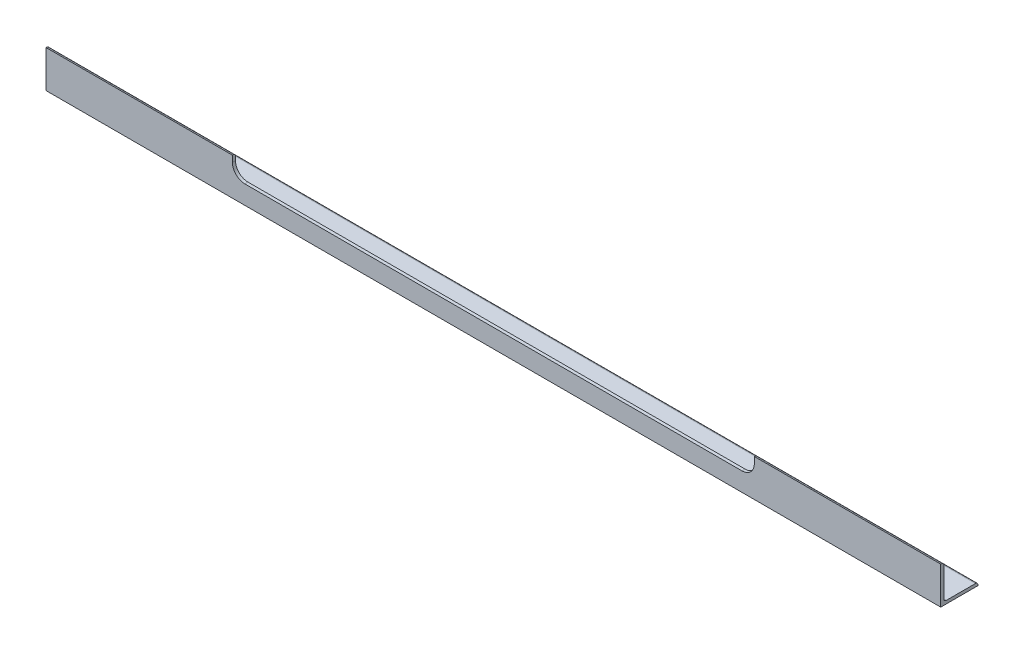
ISO-10303-21;
HEADER;
FILE_DESCRIPTION(('STEP AP214'),'2;1');
FILE_NAME('part.step','',(''),(''),'','','');
FILE_SCHEMA(('AUTOMOTIVE_DESIGN { 1 0 10303 214 1 1 1 1 }'));
ENDSEC;
DATA;
#1=APPLICATION_CONTEXT('core data for automotive mechanical design processes');
#2=APPLICATION_PROTOCOL_DEFINITION('international standard','automotive_design',2000,#1);
#3=PRODUCT_CONTEXT('',#1,'mechanical');
#4=PRODUCT('Part','Part','',(#3));
#5=PRODUCT_RELATED_PRODUCT_CATEGORY('part','',(#4));
#6=PRODUCT_DEFINITION_FORMATION('','',#4);
#7=PRODUCT_DEFINITION_CONTEXT('part definition',#1,'design');
#8=PRODUCT_DEFINITION('design','',#6,#7);
#9=PRODUCT_DEFINITION_SHAPE('','',#8);
#10=(LENGTH_UNIT() NAMED_UNIT(*) SI_UNIT(.MILLI.,.METRE.));
#11=(NAMED_UNIT(*) PLANE_ANGLE_UNIT() SI_UNIT($,.RADIAN.));
#12=(NAMED_UNIT(*) SI_UNIT($,.STERADIAN.) SOLID_ANGLE_UNIT());
#13=UNCERTAINTY_MEASURE_WITH_UNIT(LENGTH_MEASURE(1.E-05),#10,'distance_accuracy_value','');
#14=(GEOMETRIC_REPRESENTATION_CONTEXT(3) GLOBAL_UNCERTAINTY_ASSIGNED_CONTEXT((#13)) GLOBAL_UNIT_ASSIGNED_CONTEXT((#10,
#11,#12)) REPRESENTATION_CONTEXT('',''));
#15=CARTESIAN_POINT('',(0.,0.,0.));
#16=DIRECTION('',(0.,0.,1.));
#17=DIRECTION('',(1.,0.,0.));
#18=AXIS2_PLACEMENT_3D('',#15,#16,#17);
#19=CARTESIAN_POINT('',(-914.4,76.2,0.));
#20=DIRECTION('',(0.,1.,0.));
#21=DIRECTION('',(0.,0.,1.));
#22=AXIS2_PLACEMENT_3D('',#19,#20,#21);
#23=PLANE('',#22);
#24=DIRECTION('',(0.,0.,1.));
#25=VECTOR('',#24,1.);
#26=CARTESIAN_POINT('',(-533.4,76.2,-76.2));
#27=LINE('',#26,#25);
#28=CARTESIAN_POINT('',(-533.4,76.2,-1.27000000000002));
#29=VERTEX_POINT('',#28);
#30=CARTESIAN_POINT('',(-533.4,76.2,0.));
#31=VERTEX_POINT('',#30);
#32=EDGE_CURVE('E164',#29,#31,#27,.T.);
#33=ORIENTED_EDGE('',*,*,#32,.F.);
#34=DIRECTION('',(1.,0.,0.));
#35=VECTOR('',#34,1.);
#36=CARTESIAN_POINT('',(-914.4,76.2,-1.26999999999996));
#37=LINE('',#36,#35);
#38=CARTESIAN_POINT('',(-914.4,76.2,-1.26999999999996));
#39=VERTEX_POINT('',#38);
#40=EDGE_CURVE('E183',#39,#29,#37,.T.);
#41=ORIENTED_EDGE('',*,*,#40,.F.);
#42=DIRECTION('',(0.,0.,1.));
#43=VECTOR('',#42,1.);
#44=CARTESIAN_POINT('',(-914.4,76.2,0.));
#45=LINE('',#44,#43);
#46=CARTESIAN_POINT('',(-914.4,76.2,0.));
#47=VERTEX_POINT('',#46);
#48=EDGE_CURVE('E245',#39,#47,#45,.T.);
#49=ORIENTED_EDGE('',*,*,#48,.T.);
#50=DIRECTION('',(1.,0.,0.));
#51=VECTOR('',#50,1.);
#52=CARTESIAN_POINT('',(-914.4,76.2,0.));
#53=LINE('',#52,#51);
#54=EDGE_CURVE('E170',#47,#31,#53,.T.);
#55=ORIENTED_EDGE('',*,*,#54,.T.);
#56=EDGE_LOOP('',(#33,#41,#49,#55));
#57=FACE_BOUND('',#56,.T.);
#58=ADVANCED_FACE('F34',(#57),#23,.T.);
#59=CARTESIAN_POINT('',(-914.4,71.12,-1.27));
#60=DIRECTION('',(1.,0.,0.));
#61=DIRECTION('',(0.,0.,-1.));
#62=AXIS2_PLACEMENT_3D('',#59,#60,#61);
#63=CYLINDRICAL_SURFACE('',#62,5.08);
#64=CARTESIAN_POINT('',(-533.4,71.12,-1.27));
#65=DIRECTION('',(-1.,0.,0.));
#66=DIRECTION('',(0.,0.,1.));
#67=AXIS2_PLACEMENT_3D('',#64,#65,#66);
#68=CIRCLE('',#67,5.08);
#69=CARTESIAN_POINT('',(-533.4,71.12,-6.35));
#70=VERTEX_POINT('',#69);
#71=EDGE_CURVE('E219',#70,#29,#68,.F.);
#72=ORIENTED_EDGE('',*,*,#71,.F.);
#73=DIRECTION('',(1.,0.,0.));
#74=VECTOR('',#73,1.);
#75=CARTESIAN_POINT('',(-914.4,71.12,-6.35));
#76=LINE('',#75,#74);
#77=CARTESIAN_POINT('',(-914.4,71.12,-6.35));
#78=VERTEX_POINT('',#77);
#79=EDGE_CURVE('E270',#78,#70,#76,.T.);
#80=ORIENTED_EDGE('',*,*,#79,.F.);
#81=CARTESIAN_POINT('',(-914.4,71.12,-1.27));
#82=DIRECTION('',(1.,0.,0.));
#83=DIRECTION('',(0.,0.,-1.));
#84=AXIS2_PLACEMENT_3D('',#81,#82,#83);
#85=CIRCLE('',#84,5.08);
#86=EDGE_CURVE('E171',#78,#39,#85,.T.);
#87=ORIENTED_EDGE('',*,*,#86,.T.);
#88=ORIENTED_EDGE('',*,*,#40,.T.);
#89=EDGE_LOOP('',(#72,#80,#87,#88));
#90=FACE_BOUND('',#89,.T.);
#91=ADVANCED_FACE('F303',(#90),#63,.T.);
#92=DIRECTION('',(0.,0.,1.));
#93=VECTOR('',#92,1.);
#94=CARTESIAN_POINT('',(533.4,76.2,-76.2));
#95=LINE('',#94,#93);
#96=CARTESIAN_POINT('',(533.4,76.2,-1.27));
#97=VERTEX_POINT('',#96);
#98=CARTESIAN_POINT('',(533.4,76.2,0.));
#99=VERTEX_POINT('',#98);
#100=EDGE_CURVE('E150',#97,#99,#95,.T.);
#101=ORIENTED_EDGE('',*,*,#100,.T.);
#102=CARTESIAN_POINT('',(914.4,76.2,0.));
#103=VERTEX_POINT('',#102);
#104=EDGE_CURVE('E161',#99,#103,#53,.T.);
#105=ORIENTED_EDGE('',*,*,#104,.T.);
#106=DIRECTION('',(0.,0.,1.));
#107=VECTOR('',#106,1.);
#108=CARTESIAN_POINT('',(914.4,76.2,0.));
#109=LINE('',#108,#107);
#110=CARTESIAN_POINT('',(914.4,76.2,-1.26999999999996));
#111=VERTEX_POINT('',#110);
#112=EDGE_CURVE('E221',#111,#103,#109,.T.);
#113=ORIENTED_EDGE('',*,*,#112,.F.);
#114=EDGE_CURVE('E163',#97,#111,#37,.T.);
#115=ORIENTED_EDGE('',*,*,#114,.F.);
#116=EDGE_LOOP('',(#101,#105,#113,#115));
#117=FACE_BOUND('',#116,.T.);
#118=ADVANCED_FACE('F159',(#117),#23,.T.);
#119=CARTESIAN_POINT('',(533.4,71.12,-1.27));
#120=DIRECTION('',(1.,0.,0.));
#121=DIRECTION('',(0.,0.,-1.));
#122=AXIS2_PLACEMENT_3D('',#119,#120,#121);
#123=CIRCLE('',#122,5.08);
#124=CARTESIAN_POINT('',(533.4,71.12,-6.35));
#125=VERTEX_POINT('',#124);
#126=EDGE_CURVE('E203',#97,#125,#123,.F.);
#127=ORIENTED_EDGE('',*,*,#126,.F.);
#128=ORIENTED_EDGE('',*,*,#114,.T.);
#129=CARTESIAN_POINT('',(914.4,71.12,-1.27));
#130=DIRECTION('',(1.,0.,0.));
#131=DIRECTION('',(0.,0.,-1.));
#132=AXIS2_PLACEMENT_3D('',#129,#130,#131);
#133=CIRCLE('',#132,5.08);
#134=CARTESIAN_POINT('',(914.4,71.12,-6.35));
#135=VERTEX_POINT('',#134);
#136=EDGE_CURVE('E242',#135,#111,#133,.T.);
#137=ORIENTED_EDGE('',*,*,#136,.F.);
#138=EDGE_CURVE('E273',#125,#135,#76,.T.);
#139=ORIENTED_EDGE('',*,*,#138,.F.);
#140=EDGE_LOOP('',(#127,#128,#137,#139));
#141=FACE_BOUND('',#140,.T.);
#142=ADVANCED_FACE('F311',(#141),#63,.T.);
#143=CARTESIAN_POINT('',(-914.4,71.12,-6.35));
#144=DIRECTION('',(0.,0.,-1.));
#145=DIRECTION('',(-1.,0.,0.));
#146=AXIS2_PLACEMENT_3D('',#143,#144,#145);
#147=PLANE('',#146);
#148=DIRECTION('',(0.,1.,0.));
#149=VECTOR('',#148,1.);
#150=CARTESIAN_POINT('',(-533.4,71.12,-6.35));
#151=LINE('',#150,#149);
#152=CARTESIAN_POINT('',(-533.4,63.5,-6.35));
#153=VERTEX_POINT('',#152);
#154=EDGE_CURVE('E217',#153,#70,#151,.T.);
#155=ORIENTED_EDGE('',*,*,#154,.F.);
#156=CARTESIAN_POINT('',(-508.,63.5,-6.34999999999999));
#157=DIRECTION('',(0.,0.,-1.));
#158=DIRECTION('',(-1.,0.,0.));
#159=AXIS2_PLACEMENT_3D('',#156,#157,#158);
#160=CIRCLE('',#159,25.4);
#161=CARTESIAN_POINT('',(-508.,38.1,-6.35));
#162=VERTEX_POINT('',#161);
#163=EDGE_CURVE('E11',#153,#162,#160,.F.);
#164=ORIENTED_EDGE('',*,*,#163,.T.);
#165=DIRECTION('',(-1.,0.,0.));
#166=VECTOR('',#165,1.);
#167=CARTESIAN_POINT('',(-914.4,38.1,-6.35));
#168=LINE('',#167,#166);
#169=CARTESIAN_POINT('',(508.,38.1,-6.35));
#170=VERTEX_POINT('',#169);
#171=EDGE_CURVE('E200',#170,#162,#168,.T.);
#172=ORIENTED_EDGE('',*,*,#171,.F.);
#173=CARTESIAN_POINT('',(508.,63.5,-6.34999999999999));
#174=DIRECTION('',(0.,0.,-1.));
#175=DIRECTION('',(-1.,0.,0.));
#176=AXIS2_PLACEMENT_3D('',#173,#174,#175);
#177=CIRCLE('',#176,25.4);
#178=CARTESIAN_POINT('',(533.4,63.5,-6.35));
#179=VERTEX_POINT('',#178);
#180=EDGE_CURVE('E191',#170,#179,#177,.F.);
#181=ORIENTED_EDGE('',*,*,#180,.T.);
#182=DIRECTION('',(0.,-1.,0.));
#183=VECTOR('',#182,1.);
#184=CARTESIAN_POINT('',(533.4,71.12,-6.35));
#185=LINE('',#184,#183);
#186=EDGE_CURVE('E197',#125,#179,#185,.T.);
#187=ORIENTED_EDGE('',*,*,#186,.F.);
#188=ORIENTED_EDGE('',*,*,#138,.T.);
#189=DIRECTION('',(0.,1.,0.));
#190=VECTOR('',#189,1.);
#191=CARTESIAN_POINT('',(914.4,71.12,-6.35));
#192=LINE('',#191,#190);
#193=CARTESIAN_POINT('',(914.4,11.43,-6.35));
#194=VERTEX_POINT('',#193);
#195=EDGE_CURVE('E239',#194,#135,#192,.T.);
#196=ORIENTED_EDGE('',*,*,#195,.F.);
#197=DIRECTION('',(1.,0.,0.));
#198=VECTOR('',#197,1.);
#199=CARTESIAN_POINT('',(-914.4,11.43,-6.35));
#200=LINE('',#199,#198);
#201=CARTESIAN_POINT('',(-914.4,11.43,-6.35));
#202=VERTEX_POINT('',#201);
#203=EDGE_CURVE('E274',#202,#194,#200,.T.);
#204=ORIENTED_EDGE('',*,*,#203,.F.);
#205=DIRECTION('',(0.,1.,0.));
#206=VECTOR('',#205,1.);
#207=CARTESIAN_POINT('',(-914.4,71.12,-6.35));
#208=LINE('',#207,#206);
#209=EDGE_CURVE('E176',#202,#78,#208,.T.);
#210=ORIENTED_EDGE('',*,*,#209,.T.);
#211=ORIENTED_EDGE('',*,*,#79,.T.);
#212=EDGE_LOOP('',(#155,#164,#172,#181,#187,#188,#196,#204,#210,#211));
#213=FACE_BOUND('',#212,.T.);
#214=ADVANCED_FACE('F196',(#213),#147,.T.);
#215=CARTESIAN_POINT('',(-914.4,11.43,-11.43));
#216=DIRECTION('',(1.,0.,0.));
#217=DIRECTION('',(0.,0.,-1.));
#218=AXIS2_PLACEMENT_3D('',#215,#216,#217);
#219=CYLINDRICAL_SURFACE('',#218,5.08);
#220=ORIENTED_EDGE('',*,*,#203,.T.);
#221=CARTESIAN_POINT('',(914.4,11.43,-11.43));
#222=DIRECTION('',(-1.,0.,0.));
#223=DIRECTION('',(0.,0.,-1.));
#224=AXIS2_PLACEMENT_3D('',#221,#222,#223);
#225=CIRCLE('',#224,5.08);
#226=CARTESIAN_POINT('',(914.4,6.35,-11.43));
#227=VERTEX_POINT('',#226);
#228=EDGE_CURVE('E236',#227,#194,#225,.T.);
#229=ORIENTED_EDGE('',*,*,#228,.F.);
#230=DIRECTION('',(1.,0.,0.));
#231=VECTOR('',#230,1.);
#232=CARTESIAN_POINT('',(-914.4,6.35,-11.43));
#233=LINE('',#232,#231);
#234=CARTESIAN_POINT('',(-914.4,6.35,-11.43));
#235=VERTEX_POINT('',#234);
#236=EDGE_CURVE('E276',#235,#227,#233,.T.);
#237=ORIENTED_EDGE('',*,*,#236,.F.);
#238=CARTESIAN_POINT('',(-914.4,11.43,-11.43));
#239=DIRECTION('',(-1.,0.,0.));
#240=DIRECTION('',(0.,0.,-1.));
#241=AXIS2_PLACEMENT_3D('',#238,#239,#240);
#242=CIRCLE('',#241,5.08);
#243=EDGE_CURVE('E263',#235,#202,#242,.T.);
#244=ORIENTED_EDGE('',*,*,#243,.T.);
#245=EDGE_LOOP('',(#220,#229,#237,#244));
#246=FACE_BOUND('',#245,.T.);
#247=ADVANCED_FACE('F321',(#246),#219,.F.);
#248=CARTESIAN_POINT('',(-914.4,6.35,-11.43));
#249=DIRECTION('',(0.,1.,0.));
#250=DIRECTION('',(0.,0.,1.));
#251=AXIS2_PLACEMENT_3D('',#248,#249,#250);
#252=PLANE('',#251);
#253=ORIENTED_EDGE('',*,*,#236,.T.);
#254=DIRECTION('',(0.,0.,1.));
#255=VECTOR('',#254,1.);
#256=CARTESIAN_POINT('',(914.4,6.35,-11.43));
#257=LINE('',#256,#255);
#258=CARTESIAN_POINT('',(914.4,6.35,-71.12));
#259=VERTEX_POINT('',#258);
#260=EDGE_CURVE('E233',#259,#227,#257,.T.);
#261=ORIENTED_EDGE('',*,*,#260,.F.);
#262=DIRECTION('',(1.,0.,0.));
#263=VECTOR('',#262,1.);
#264=CARTESIAN_POINT('',(-914.4,6.35,-71.12));
#265=LINE('',#264,#263);
#266=CARTESIAN_POINT('',(-914.4,6.35,-71.12));
#267=VERTEX_POINT('',#266);
#268=EDGE_CURVE('E278',#267,#259,#265,.T.);
#269=ORIENTED_EDGE('',*,*,#268,.F.);
#270=DIRECTION('',(0.,0.,1.));
#271=VECTOR('',#270,1.);
#272=CARTESIAN_POINT('',(-914.4,6.35,-11.43));
#273=LINE('',#272,#271);
#274=EDGE_CURVE('E260',#267,#235,#273,.T.);
#275=ORIENTED_EDGE('',*,*,#274,.T.);
#276=EDGE_LOOP('',(#253,#261,#269,#275));
#277=FACE_BOUND('',#276,.T.);
#278=ADVANCED_FACE('F328',(#277),#252,.T.);
#279=CARTESIAN_POINT('',(-914.4,1.27,-71.12));
#280=DIRECTION('',(1.,0.,0.));
#281=DIRECTION('',(0.,0.,-1.));
#282=AXIS2_PLACEMENT_3D('',#279,#280,#281);
#283=CYLINDRICAL_SURFACE('',#282,5.08);
#284=ORIENTED_EDGE('',*,*,#268,.T.);
#285=CARTESIAN_POINT('',(914.4,1.27,-71.12));
#286=DIRECTION('',(1.,0.,0.));
#287=DIRECTION('',(0.,0.,1.));
#288=AXIS2_PLACEMENT_3D('',#285,#286,#287);
#289=CIRCLE('',#288,5.08);
#290=CARTESIAN_POINT('',(914.4,1.26999999999996,-76.2));
#291=VERTEX_POINT('',#290);
#292=EDGE_CURVE('E230',#291,#259,#289,.T.);
#293=ORIENTED_EDGE('',*,*,#292,.F.);
#294=DIRECTION('',(1.,0.,0.));
#295=VECTOR('',#294,1.);
#296=CARTESIAN_POINT('',(-914.4,1.26999999999996,-76.2));
#297=LINE('',#296,#295);
#298=CARTESIAN_POINT('',(-914.4,1.26999999999996,-76.2));
#299=VERTEX_POINT('',#298);
#300=EDGE_CURVE('E280',#299,#291,#297,.T.);
#301=ORIENTED_EDGE('',*,*,#300,.F.);
#302=CARTESIAN_POINT('',(-914.4,1.27,-71.12));
#303=DIRECTION('',(1.,0.,0.));
#304=DIRECTION('',(0.,0.,1.));
#305=AXIS2_PLACEMENT_3D('',#302,#303,#304);
#306=CIRCLE('',#305,5.08);
#307=EDGE_CURVE('E257',#299,#267,#306,.T.);
#308=ORIENTED_EDGE('',*,*,#307,.T.);
#309=EDGE_LOOP('',(#284,#293,#301,#308));
#310=FACE_BOUND('',#309,.T.);
#311=ADVANCED_FACE('F299',(#310),#283,.T.);
#312=CARTESIAN_POINT('',(-914.4,1.26999999999996,-76.2));
#313=DIRECTION('',(0.,0.,-1.));
#314=DIRECTION('',(-1.,0.,0.));
#315=AXIS2_PLACEMENT_3D('',#312,#313,#314);
#316=PLANE('',#315);
#317=ORIENTED_EDGE('',*,*,#300,.T.);
#318=DIRECTION('',(0.,1.,0.));
#319=VECTOR('',#318,1.);
#320=CARTESIAN_POINT('',(914.4,1.26999999999996,-76.2));
#321=LINE('',#320,#319);
#322=CARTESIAN_POINT('',(914.4,0.,-76.2));
#323=VERTEX_POINT('',#322);
#324=EDGE_CURVE('E227',#323,#291,#321,.T.);
#325=ORIENTED_EDGE('',*,*,#324,.F.);
#326=DIRECTION('',(1.,0.,0.));
#327=VECTOR('',#326,1.);
#328=CARTESIAN_POINT('',(-914.4,0.,-76.2));
#329=LINE('',#328,#327);
#330=CARTESIAN_POINT('',(-914.4,0.,-76.2));
#331=VERTEX_POINT('',#330);
#332=EDGE_CURVE('E281',#331,#323,#329,.T.);
#333=ORIENTED_EDGE('',*,*,#332,.F.);
#334=DIRECTION('',(0.,1.,0.));
#335=VECTOR('',#334,1.);
#336=CARTESIAN_POINT('',(-914.4,1.26999999999996,-76.2));
#337=LINE('',#336,#335);
#338=EDGE_CURVE('E254',#331,#299,#337,.T.);
#339=ORIENTED_EDGE('',*,*,#338,.T.);
#340=EDGE_LOOP('',(#317,#325,#333,#339));
#341=FACE_BOUND('',#340,.T.);
#342=ADVANCED_FACE('F291',(#341),#316,.T.);
#343=CARTESIAN_POINT('',(-914.4,0.,0.));
#344=DIRECTION('',(0.,-1.,0.));
#345=DIRECTION('',(0.,0.,-1.));
#346=AXIS2_PLACEMENT_3D('',#343,#344,#345);
#347=PLANE('',#346);
#348=ORIENTED_EDGE('',*,*,#332,.T.);
#349=DIRECTION('',(0.,0.,-1.));
#350=VECTOR('',#349,1.);
#351=CARTESIAN_POINT('',(914.4,0.,0.));
#352=LINE('',#351,#350);
#353=CARTESIAN_POINT('',(914.4,0.,0.));
#354=VERTEX_POINT('',#353);
#355=EDGE_CURVE('E224',#354,#323,#352,.T.);
#356=ORIENTED_EDGE('',*,*,#355,.F.);
#357=DIRECTION('',(1.,0.,0.));
#358=VECTOR('',#357,1.);
#359=CARTESIAN_POINT('',(-914.4,0.,0.));
#360=LINE('',#359,#358);
#361=CARTESIAN_POINT('',(-914.4,0.,0.));
#362=VERTEX_POINT('',#361);
#363=EDGE_CURVE('E174',#362,#354,#360,.T.);
#364=ORIENTED_EDGE('',*,*,#363,.F.);
#365=DIRECTION('',(0.,0.,-1.));
#366=VECTOR('',#365,1.);
#367=CARTESIAN_POINT('',(-914.4,0.,0.));
#368=LINE('',#367,#366);
#369=EDGE_CURVE('E251',#362,#331,#368,.T.);
#370=ORIENTED_EDGE('',*,*,#369,.T.);
#371=EDGE_LOOP('',(#348,#356,#364,#370));
#372=FACE_BOUND('',#371,.T.);
#373=ADVANCED_FACE('F289',(#372),#347,.T.);
#374=CARTESIAN_POINT('',(-914.4,76.2,0.));
#375=DIRECTION('',(0.,0.,1.));
#376=DIRECTION('',(1.,0.,0.));
#377=AXIS2_PLACEMENT_3D('',#374,#375,#376);
#378=PLANE('',#377);
#379=DIRECTION('',(0.,-1.,0.));
#380=VECTOR('',#379,1.);
#381=CARTESIAN_POINT('',(-533.4,76.2,0.));
#382=LINE('',#381,#380);
#383=CARTESIAN_POINT('',(-533.4,63.5,0.));
#384=VERTEX_POINT('',#383);
#385=EDGE_CURVE('E210',#31,#384,#382,.T.);
#386=ORIENTED_EDGE('',*,*,#385,.F.);
#387=ORIENTED_EDGE('',*,*,#54,.F.);
#388=DIRECTION('',(0.,-1.,0.));
#389=VECTOR('',#388,1.);
#390=CARTESIAN_POINT('',(-914.4,76.2,0.));
#391=LINE('',#390,#389);
#392=EDGE_CURVE('E248',#47,#362,#391,.T.);
#393=ORIENTED_EDGE('',*,*,#392,.T.);
#394=ORIENTED_EDGE('',*,*,#363,.T.);
#395=DIRECTION('',(0.,-1.,0.));
#396=VECTOR('',#395,1.);
#397=CARTESIAN_POINT('',(914.4,76.2,0.));
#398=LINE('',#397,#396);
#399=EDGE_CURVE('E168',#103,#354,#398,.T.);
#400=ORIENTED_EDGE('',*,*,#399,.F.);
#401=ORIENTED_EDGE('',*,*,#104,.F.);
#402=DIRECTION('',(0.,1.,0.));
#403=VECTOR('',#402,1.);
#404=CARTESIAN_POINT('',(533.4,76.2,0.));
#405=LINE('',#404,#403);
#406=CARTESIAN_POINT('',(533.4,63.5,0.));
#407=VERTEX_POINT('',#406);
#408=EDGE_CURVE('E146',#407,#99,#405,.T.);
#409=ORIENTED_EDGE('',*,*,#408,.F.);
#410=CARTESIAN_POINT('',(508.,63.5,0.));
#411=DIRECTION('',(0.,0.,1.));
#412=DIRECTION('',(1.,0.,0.));
#413=AXIS2_PLACEMENT_3D('',#410,#411,#412);
#414=CIRCLE('',#413,25.4);
#415=CARTESIAN_POINT('',(508.,38.1,0.));
#416=VERTEX_POINT('',#415);
#417=EDGE_CURVE('E189',#407,#416,#414,.F.);
#418=ORIENTED_EDGE('',*,*,#417,.T.);
#419=DIRECTION('',(1.,0.,0.));
#420=VECTOR('',#419,1.);
#421=CARTESIAN_POINT('',(-533.4,38.1,0.));
#422=LINE('',#421,#420);
#423=CARTESIAN_POINT('',(-508.,38.1,0.));
#424=VERTEX_POINT('',#423);
#425=EDGE_CURVE('E155',#424,#416,#422,.T.);
#426=ORIENTED_EDGE('',*,*,#425,.F.);
#427=CARTESIAN_POINT('',(-508.,63.5,0.));
#428=DIRECTION('',(0.,0.,1.));
#429=DIRECTION('',(1.,0.,0.));
#430=AXIS2_PLACEMENT_3D('',#427,#428,#429);
#431=CIRCLE('',#430,25.4);
#432=EDGE_CURVE('E42',#424,#384,#431,.F.);
#433=ORIENTED_EDGE('',*,*,#432,.T.);
#434=EDGE_LOOP('',(#386,#387,#393,#394,#400,#401,#409,#418,#426,#433));
#435=FACE_BOUND('',#434,.T.);
#436=ADVANCED_FACE('F166',(#435),#378,.T.);
#437=CARTESIAN_POINT('',(-914.4,71.12,-1.27));
#438=DIRECTION('',(1.,0.,0.));
#439=DIRECTION('',(0.,0.,-1.));
#440=AXIS2_PLACEMENT_3D('',#437,#438,#439);
#441=PLANE('',#440);
#442=ORIENTED_EDGE('',*,*,#48,.F.);
#443=ORIENTED_EDGE('',*,*,#86,.F.);
#444=ORIENTED_EDGE('',*,*,#209,.F.);
#445=ORIENTED_EDGE('',*,*,#243,.F.);
#446=ORIENTED_EDGE('',*,*,#274,.F.);
#447=ORIENTED_EDGE('',*,*,#307,.F.);
#448=ORIENTED_EDGE('',*,*,#338,.F.);
#449=ORIENTED_EDGE('',*,*,#369,.F.);
#450=ORIENTED_EDGE('',*,*,#392,.F.);
#451=EDGE_LOOP('',(#442,#443,#444,#445,#446,#447,#448,#449,#450));
#452=FACE_BOUND('',#451,.T.);
#453=ADVANCED_FACE('F297',(#452),#441,.F.);
#454=CARTESIAN_POINT('',(914.4,71.12,-1.27));
#455=DIRECTION('',(1.,0.,0.));
#456=DIRECTION('',(0.,0.,-1.));
#457=AXIS2_PLACEMENT_3D('',#454,#455,#456);
#458=PLANE('',#457);
#459=ORIENTED_EDGE('',*,*,#112,.T.);
#460=ORIENTED_EDGE('',*,*,#399,.T.);
#461=ORIENTED_EDGE('',*,*,#355,.T.);
#462=ORIENTED_EDGE('',*,*,#324,.T.);
#463=ORIENTED_EDGE('',*,*,#292,.T.);
#464=ORIENTED_EDGE('',*,*,#260,.T.);
#465=ORIENTED_EDGE('',*,*,#228,.T.);
#466=ORIENTED_EDGE('',*,*,#195,.T.);
#467=ORIENTED_EDGE('',*,*,#136,.T.);
#468=EDGE_LOOP('',(#459,#460,#461,#462,#463,#464,#465,#466,#467));
#469=FACE_BOUND('',#468,.T.);
#470=ADVANCED_FACE('F287',(#469),#458,.T.);
#471=CARTESIAN_POINT('',(-533.4,76.2,-76.2));
#472=DIRECTION('',(-1.,0.,0.));
#473=DIRECTION('',(0.,0.,1.));
#474=AXIS2_PLACEMENT_3D('',#471,#472,#473);
#475=PLANE('',#474);
#476=ORIENTED_EDGE('',*,*,#385,.T.);
#477=DIRECTION('',(0.,0.,1.));
#478=VECTOR('',#477,1.);
#479=CARTESIAN_POINT('',(-533.4,63.5,-6.35000000000002));
#480=LINE('',#479,#478);
#481=EDGE_CURVE('E49',#384,#153,#480,.F.);
#482=ORIENTED_EDGE('',*,*,#481,.T.);
#483=ORIENTED_EDGE('',*,*,#154,.T.);
#484=ORIENTED_EDGE('',*,*,#71,.T.);
#485=ORIENTED_EDGE('',*,*,#32,.T.);
#486=EDGE_LOOP('',(#476,#482,#483,#484,#485));
#487=FACE_BOUND('',#486,.T.);
#488=ADVANCED_FACE('F351',(#487),#475,.F.);
#489=CARTESIAN_POINT('',(533.4,76.2,-76.2));
#490=DIRECTION('',(1.,0.,0.));
#491=DIRECTION('',(0.,0.,-1.));
#492=AXIS2_PLACEMENT_3D('',#489,#490,#491);
#493=PLANE('',#492);
#494=ORIENTED_EDGE('',*,*,#186,.T.);
#495=DIRECTION('',(0.,0.,1.));
#496=VECTOR('',#495,1.);
#497=CARTESIAN_POINT('',(533.4,63.5,0.));
#498=LINE('',#497,#496);
#499=EDGE_CURVE('E153',#179,#407,#498,.T.);
#500=ORIENTED_EDGE('',*,*,#499,.T.);
#501=ORIENTED_EDGE('',*,*,#408,.T.);
#502=ORIENTED_EDGE('',*,*,#100,.F.);
#503=ORIENTED_EDGE('',*,*,#126,.T.);
#504=EDGE_LOOP('',(#494,#500,#501,#502,#503));
#505=FACE_BOUND('',#504,.T.);
#506=ADVANCED_FACE('F149',(#505),#493,.F.);
#507=CARTESIAN_POINT('',(-533.4,38.1,-76.2));
#508=DIRECTION('',(0.,-1.,0.));
#509=DIRECTION('',(0.,0.,-1.));
#510=AXIS2_PLACEMENT_3D('',#507,#508,#509);
#511=PLANE('',#510);
#512=ORIENTED_EDGE('',*,*,#425,.T.);
#513=DIRECTION('',(0.,0.,1.));
#514=VECTOR('',#513,1.);
#515=CARTESIAN_POINT('',(508.,38.1,-6.35000000000002));
#516=LINE('',#515,#514);
#517=EDGE_CURVE('E186',#416,#170,#516,.F.);
#518=ORIENTED_EDGE('',*,*,#517,.T.);
#519=ORIENTED_EDGE('',*,*,#171,.T.);
#520=DIRECTION('',(0.,0.,1.));
#521=VECTOR('',#520,1.);
#522=CARTESIAN_POINT('',(-508.,38.1,0.));
#523=LINE('',#522,#521);
#524=EDGE_CURVE('E182',#162,#424,#523,.T.);
#525=ORIENTED_EDGE('',*,*,#524,.T.);
#526=EDGE_LOOP('',(#512,#518,#519,#525));
#527=FACE_BOUND('',#526,.T.);
#528=ADVANCED_FACE('F208',(#527),#511,.F.);
#529=CARTESIAN_POINT('',(508.,63.5,-76.2));
#530=DIRECTION('',(0.,0.,-1.));
#531=DIRECTION('',(-1.,0.,0.));
#532=AXIS2_PLACEMENT_3D('',#529,#530,#531);
#533=CYLINDRICAL_SURFACE('',#532,25.4);
#534=ORIENTED_EDGE('',*,*,#180,.F.);
#535=ORIENTED_EDGE('',*,*,#517,.F.);
#536=ORIENTED_EDGE('',*,*,#417,.F.);
#537=ORIENTED_EDGE('',*,*,#499,.F.);
#538=EDGE_LOOP('',(#534,#535,#536,#537));
#539=FACE_BOUND('',#538,.T.);
#540=ADVANCED_FACE('F205',(#539),#533,.F.);
#541=CARTESIAN_POINT('',(-508.,63.5,-76.2));
#542=DIRECTION('',(0.,0.,-1.));
#543=DIRECTION('',(-1.,0.,0.));
#544=AXIS2_PLACEMENT_3D('',#541,#542,#543);
#545=CYLINDRICAL_SURFACE('',#544,25.4);
#546=ORIENTED_EDGE('',*,*,#163,.F.);
#547=ORIENTED_EDGE('',*,*,#481,.F.);
#548=ORIENTED_EDGE('',*,*,#432,.F.);
#549=ORIENTED_EDGE('',*,*,#524,.F.);
#550=EDGE_LOOP('',(#546,#547,#548,#549));
#551=FACE_BOUND('',#550,.T.);
#552=ADVANCED_FACE('F36',(#551),#545,.F.);
#553=CLOSED_SHELL('',(#58,#91,#118,#142,#214,#247,#278,#311,#342,#373,#436,#453,#470,#488,#506,
#528,#540,#552));
#554=MANIFOLD_SOLID_BREP('B2',#553);
#555=ADVANCED_BREP_SHAPE_REPRESENTATION('',(#18,#554),#14);
#556=SHAPE_DEFINITION_REPRESENTATION(#9,#555);
ENDSEC;
END-ISO-10303-21;
